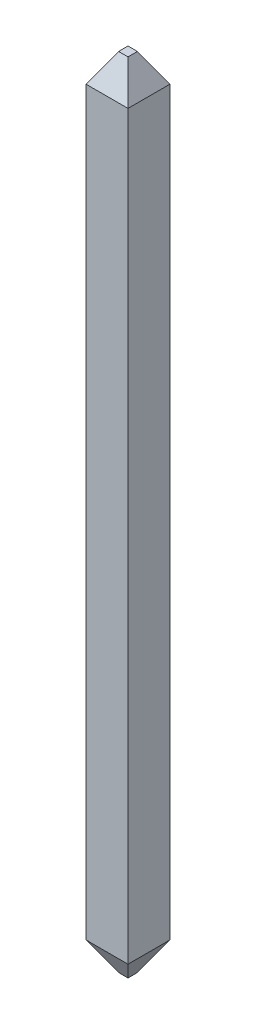
ISO-10303-21;
HEADER;
FILE_DESCRIPTION(('STEP AP214'),'2;1');
FILE_NAME('part.step','',(''),(''),'','','');
FILE_SCHEMA(('AUTOMOTIVE_DESIGN { 1 0 10303 214 1 1 1 1 }'));
ENDSEC;
DATA;
#1=APPLICATION_CONTEXT('core data for automotive mechanical design processes');
#2=APPLICATION_PROTOCOL_DEFINITION('international standard','automotive_design',2000,#1);
#3=PRODUCT_CONTEXT('',#1,'mechanical');
#4=PRODUCT('Part','Part','',(#3));
#5=PRODUCT_RELATED_PRODUCT_CATEGORY('part','',(#4));
#6=PRODUCT_DEFINITION_FORMATION('','',#4);
#7=PRODUCT_DEFINITION_CONTEXT('part definition',#1,'design');
#8=PRODUCT_DEFINITION('design','',#6,#7);
#9=PRODUCT_DEFINITION_SHAPE('','',#8);
#10=(LENGTH_UNIT() NAMED_UNIT(*) SI_UNIT(.MILLI.,.METRE.));
#11=(NAMED_UNIT(*) PLANE_ANGLE_UNIT() SI_UNIT($,.RADIAN.));
#12=(NAMED_UNIT(*) SI_UNIT($,.STERADIAN.) SOLID_ANGLE_UNIT());
#13=UNCERTAINTY_MEASURE_WITH_UNIT(LENGTH_MEASURE(1.E-05),#10,'distance_accuracy_value','');
#14=(GEOMETRIC_REPRESENTATION_CONTEXT(3) GLOBAL_UNCERTAINTY_ASSIGNED_CONTEXT((#13)) GLOBAL_UNIT_ASSIGNED_CONTEXT((#10,
#11,#12)) REPRESENTATION_CONTEXT('',''));
#15=CARTESIAN_POINT('',(0.,0.,0.));
#16=DIRECTION('',(0.,0.,1.));
#17=DIRECTION('',(1.,0.,0.));
#18=AXIS2_PLACEMENT_3D('',#15,#16,#17);
#19=CARTESIAN_POINT('',(-0.075,12.7,0.));
#20=DIRECTION('',(-0.866025403784436,0.5,0.));
#21=DIRECTION('',(0.,0.,1.));
#22=AXIS2_PLACEMENT_3D('',#19,#20,#21);
#23=PLANE('',#22);
#24=DIRECTION('',(-0.447213595499961,-0.774596669241479,0.447213595499962));
#25=VECTOR('',#24,1.);
#26=CARTESIAN_POINT('',(-0.075,12.7,0.0749999999999992));
#27=LINE('',#26,#25);
#28=CARTESIAN_POINT('',(-0.075,12.7,0.0749999999999992));
#29=VERTEX_POINT('',#28);
#30=CARTESIAN_POINT('',(-0.335,12.2496667900321,0.335));
#31=VERTEX_POINT('',#30);
#32=EDGE_CURVE('E106',#29,#31,#27,.T.);
#33=ORIENTED_EDGE('',*,*,#32,.F.);
#34=DIRECTION('',(0.,0.,1.));
#35=VECTOR('',#34,1.);
#36=CARTESIAN_POINT('',(-0.075,12.7,0.));
#37=LINE('',#36,#35);
#38=CARTESIAN_POINT('',(-0.075,12.7,-0.075));
#39=VERTEX_POINT('',#38);
#40=EDGE_CURVE('E11',#39,#29,#37,.T.);
#41=ORIENTED_EDGE('',*,*,#40,.F.);
#42=DIRECTION('',(0.447213595499962,0.774596669241479,0.447213595499962));
#43=VECTOR('',#42,1.);
#44=CARTESIAN_POINT('',(-0.335,12.2496667900321,-0.335));
#45=LINE('',#44,#43);
#46=CARTESIAN_POINT('',(-0.335,12.2496667900321,-0.335));
#47=VERTEX_POINT('',#46);
#48=EDGE_CURVE('E138',#47,#39,#45,.T.);
#49=ORIENTED_EDGE('',*,*,#48,.F.);
#50=DIRECTION('',(0.,0.,1.));
#51=VECTOR('',#50,1.);
#52=CARTESIAN_POINT('',(-0.335,12.2496667900321,-0.335));
#53=LINE('',#52,#51);
#54=EDGE_CURVE('E108',#47,#31,#53,.T.);
#55=ORIENTED_EDGE('',*,*,#54,.T.);
#56=EDGE_LOOP('',(#33,#41,#49,#55));
#57=FACE_BOUND('',#56,.T.);
#58=ADVANCED_FACE('F17',(#57),#23,.T.);
#59=CARTESIAN_POINT('',(-0.335,0.45033320996791,-0.335));
#60=DIRECTION('',(0.866025403784439,0.5,0.));
#61=DIRECTION('',(0.,0.,-1.));
#62=AXIS2_PLACEMENT_3D('',#59,#60,#61);
#63=PLANE('',#62);
#64=DIRECTION('',(0.,0.,-1.));
#65=VECTOR('',#64,1.);
#66=CARTESIAN_POINT('',(-0.335,0.45033320996791,-0.335));
#67=LINE('',#66,#65);
#68=CARTESIAN_POINT('',(-0.335,0.45033320996791,0.335));
#69=VERTEX_POINT('',#68);
#70=CARTESIAN_POINT('',(-0.335,0.45033320996791,-0.335));
#71=VERTEX_POINT('',#70);
#72=EDGE_CURVE('E152',#69,#71,#67,.T.);
#73=ORIENTED_EDGE('',*,*,#72,.T.);
#74=DIRECTION('',(0.447213595499958,-0.774596669241484,0.447213595499957));
#75=VECTOR('',#74,1.);
#76=CARTESIAN_POINT('',(-0.335,0.45033320996791,-0.335));
#77=LINE('',#76,#75);
#78=CARTESIAN_POINT('',(-0.075,0.,-0.075));
#79=VERTEX_POINT('',#78);
#80=EDGE_CURVE('E135',#71,#79,#77,.T.);
#81=ORIENTED_EDGE('',*,*,#80,.T.);
#82=DIRECTION('',(0.,0.,1.));
#83=VECTOR('',#82,1.);
#84=CARTESIAN_POINT('',(-0.075,0.,0.));
#85=LINE('',#84,#83);
#86=CARTESIAN_POINT('',(-0.075,0.,0.0749999999999992));
#87=VERTEX_POINT('',#86);
#88=EDGE_CURVE('E94',#79,#87,#85,.T.);
#89=ORIENTED_EDGE('',*,*,#88,.T.);
#90=DIRECTION('',(-0.447213595499957,0.774596669241484,0.447213595499957));
#91=VECTOR('',#90,1.);
#92=CARTESIAN_POINT('',(-0.075,0.,0.0749999999999992));
#93=LINE('',#92,#91);
#94=EDGE_CURVE('E120',#87,#69,#93,.T.);
#95=ORIENTED_EDGE('',*,*,#94,.T.);
#96=EDGE_LOOP('',(#73,#81,#89,#95));
#97=FACE_BOUND('',#96,.T.);
#98=ADVANCED_FACE('F430',(#97),#63,.F.);
#99=CARTESIAN_POINT('',(0.,12.7,0.));
#100=DIRECTION('',(0.,1.,0.));
#101=DIRECTION('',(1.,0.,0.));
#102=AXIS2_PLACEMENT_3D('',#99,#100,#101);
#103=PLANE('',#102);
#104=DIRECTION('',(0.,0.,1.));
#105=VECTOR('',#104,1.);
#106=CARTESIAN_POINT('',(0.075,12.7,0.));
#107=LINE('',#106,#105);
#108=CARTESIAN_POINT('',(0.075,12.7,-0.075));
#109=VERTEX_POINT('',#108);
#110=CARTESIAN_POINT('',(0.075,12.7,0.0749999999999992));
#111=VERTEX_POINT('',#110);
#112=EDGE_CURVE('E149',#109,#111,#107,.T.);
#113=ORIENTED_EDGE('',*,*,#112,.F.);
#114=DIRECTION('',(1.,0.,0.));
#115=VECTOR('',#114,1.);
#116=CARTESIAN_POINT('',(0.,12.7,-0.075));
#117=LINE('',#116,#115);
#118=EDGE_CURVE('E27',#39,#109,#117,.T.);
#119=ORIENTED_EDGE('',*,*,#118,.F.);
#120=ORIENTED_EDGE('',*,*,#40,.T.);
#121=DIRECTION('',(-1.,0.,0.));
#122=VECTOR('',#121,1.);
#123=CARTESIAN_POINT('',(0.,12.7,0.0749999999999992));
#124=LINE('',#123,#122);
#125=EDGE_CURVE('E102',#111,#29,#124,.T.);
#126=ORIENTED_EDGE('',*,*,#125,.F.);
#127=EDGE_LOOP('',(#113,#119,#120,#126));
#128=FACE_BOUND('',#127,.T.);
#129=ADVANCED_FACE('F19',(#128),#103,.T.);
#130=CARTESIAN_POINT('',(0.,12.7,-0.075));
#131=DIRECTION('',(0.,0.5,-0.866025403784436));
#132=DIRECTION('',(-1.,0.,0.));
#133=AXIS2_PLACEMENT_3D('',#130,#131,#132);
#134=PLANE('',#133);
#135=ORIENTED_EDGE('',*,*,#48,.T.);
#136=ORIENTED_EDGE('',*,*,#118,.T.);
#137=DIRECTION('',(-0.447213595499962,0.774596669241479,0.447213595499962));
#138=VECTOR('',#137,1.);
#139=CARTESIAN_POINT('',(0.335,12.2496667900321,-0.335));
#140=LINE('',#139,#138);
#141=CARTESIAN_POINT('',(0.335,12.2496667900321,-0.335));
#142=VERTEX_POINT('',#141);
#143=EDGE_CURVE('E147',#142,#109,#140,.T.);
#144=ORIENTED_EDGE('',*,*,#143,.F.);
#145=DIRECTION('',(-1.,0.,0.));
#146=VECTOR('',#145,1.);
#147=CARTESIAN_POINT('',(-0.335,12.2496667900321,-0.335));
#148=LINE('',#147,#146);
#149=EDGE_CURVE('E164',#142,#47,#148,.T.);
#150=ORIENTED_EDGE('',*,*,#149,.T.);
#151=EDGE_LOOP('',(#135,#136,#144,#150));
#152=FACE_BOUND('',#151,.T.);
#153=ADVANCED_FACE('F144',(#152),#134,.T.);
#154=CARTESIAN_POINT('',(-0.335,0.45033320996791,-0.335));
#155=DIRECTION('',(0.,0.5,0.866025403784439));
#156=DIRECTION('',(1.,0.,0.));
#157=AXIS2_PLACEMENT_3D('',#154,#155,#156);
#158=PLANE('',#157);
#159=DIRECTION('',(-1.,0.,0.));
#160=VECTOR('',#159,1.);
#161=CARTESIAN_POINT('',(0.,0.,-0.075));
#162=LINE('',#161,#160);
#163=CARTESIAN_POINT('',(0.075,0.,-0.075));
#164=VERTEX_POINT('',#163);
#165=EDGE_CURVE('E113',#164,#79,#162,.T.);
#166=ORIENTED_EDGE('',*,*,#165,.T.);
#167=ORIENTED_EDGE('',*,*,#80,.F.);
#168=DIRECTION('',(1.,0.,0.));
#169=VECTOR('',#168,1.);
#170=CARTESIAN_POINT('',(-0.335,0.45033320996791,-0.335));
#171=LINE('',#170,#169);
#172=CARTESIAN_POINT('',(0.335,0.45033320996791,-0.335));
#173=VERTEX_POINT('',#172);
#174=EDGE_CURVE('E178',#71,#173,#171,.T.);
#175=ORIENTED_EDGE('',*,*,#174,.T.);
#176=DIRECTION('',(-0.447213595499957,-0.774596669241484,0.447213595499957));
#177=VECTOR('',#176,1.);
#178=CARTESIAN_POINT('',(0.335,0.45033320996791,-0.335));
#179=LINE('',#178,#177);
#180=EDGE_CURVE('E275',#173,#164,#179,.T.);
#181=ORIENTED_EDGE('',*,*,#180,.T.);
#182=EDGE_LOOP('',(#166,#167,#175,#181));
#183=FACE_BOUND('',#182,.T.);
#184=ADVANCED_FACE('F442',(#183),#158,.F.);
#185=CARTESIAN_POINT('',(0.,0.,0.));
#186=DIRECTION('',(0.,1.,0.));
#187=DIRECTION('',(1.,0.,0.));
#188=AXIS2_PLACEMENT_3D('',#185,#186,#187);
#189=PLANE('',#188);
#190=ORIENTED_EDGE('',*,*,#165,.F.);
#191=DIRECTION('',(0.,0.,1.));
#192=VECTOR('',#191,1.);
#193=CARTESIAN_POINT('',(0.0749999999999992,0.,-0.335));
#194=LINE('',#193,#192);
#195=CARTESIAN_POINT('',(0.075,0.,0.0749999999999992));
#196=VERTEX_POINT('',#195);
#197=EDGE_CURVE('E177',#164,#196,#194,.T.);
#198=ORIENTED_EDGE('',*,*,#197,.T.);
#199=DIRECTION('',(-1.,0.,0.));
#200=VECTOR('',#199,1.);
#201=CARTESIAN_POINT('',(-0.335,0.,0.0749999999999992));
#202=LINE('',#201,#200);
#203=EDGE_CURVE('E126',#196,#87,#202,.T.);
#204=ORIENTED_EDGE('',*,*,#203,.T.);
#205=ORIENTED_EDGE('',*,*,#88,.F.);
#206=EDGE_LOOP('',(#190,#198,#204,#205));
#207=FACE_BOUND('',#206,.T.);
#208=ADVANCED_FACE('F452',(#207),#189,.F.);
#209=CARTESIAN_POINT('',(0.,12.7,0.0749999999999992));
#210=DIRECTION('',(0.,0.5,0.866025403784436));
#211=DIRECTION('',(1.,0.,0.));
#212=AXIS2_PLACEMENT_3D('',#209,#210,#211);
#213=PLANE('',#212);
#214=DIRECTION('',(0.447213595499962,-0.774596669241479,0.447213595499962));
#215=VECTOR('',#214,1.);
#216=CARTESIAN_POINT('',(0.075,12.7,0.0749999999999992));
#217=LINE('',#216,#215);
#218=CARTESIAN_POINT('',(0.335,12.2496667900321,0.335));
#219=VERTEX_POINT('',#218);
#220=EDGE_CURVE('E118',#111,#219,#217,.T.);
#221=ORIENTED_EDGE('',*,*,#220,.F.);
#222=ORIENTED_EDGE('',*,*,#125,.T.);
#223=ORIENTED_EDGE('',*,*,#32,.T.);
#224=DIRECTION('',(1.,0.,0.));
#225=VECTOR('',#224,1.);
#226=CARTESIAN_POINT('',(-0.335,12.2496667900321,0.335));
#227=LINE('',#226,#225);
#228=EDGE_CURVE('E170',#31,#219,#227,.T.);
#229=ORIENTED_EDGE('',*,*,#228,.T.);
#230=EDGE_LOOP('',(#221,#222,#223,#229));
#231=FACE_BOUND('',#230,.T.);
#232=ADVANCED_FACE('F116',(#231),#213,.T.);
#233=CARTESIAN_POINT('',(-0.335,0.45033320996791,0.335));
#234=DIRECTION('',(0.,0.5,-0.866025403784439));
#235=DIRECTION('',(-1.,0.,0.));
#236=AXIS2_PLACEMENT_3D('',#233,#234,#235);
#237=PLANE('',#236);
#238=ORIENTED_EDGE('',*,*,#203,.F.);
#239=DIRECTION('',(0.447213595499958,0.774596669241484,0.447213595499957));
#240=VECTOR('',#239,1.);
#241=CARTESIAN_POINT('',(0.075,0.,0.0749999999999992));
#242=LINE('',#241,#240);
#243=CARTESIAN_POINT('',(0.335,0.45033320996791,0.335));
#244=VERTEX_POINT('',#243);
#245=EDGE_CURVE('E183',#196,#244,#242,.T.);
#246=ORIENTED_EDGE('',*,*,#245,.T.);
#247=DIRECTION('',(-1.,0.,0.));
#248=VECTOR('',#247,1.);
#249=CARTESIAN_POINT('',(-0.335,0.45033320996791,0.335));
#250=LINE('',#249,#248);
#251=EDGE_CURVE('E174',#244,#69,#250,.T.);
#252=ORIENTED_EDGE('',*,*,#251,.T.);
#253=ORIENTED_EDGE('',*,*,#94,.F.);
#254=EDGE_LOOP('',(#238,#246,#252,#253));
#255=FACE_BOUND('',#254,.T.);
#256=ADVANCED_FACE('F316',(#255),#237,.F.);
#257=CARTESIAN_POINT('',(-0.335,12.7,-0.335));
#258=DIRECTION('',(1.,0.,0.));
#259=DIRECTION('',(0.,0.,-1.));
#260=AXIS2_PLACEMENT_3D('',#257,#258,#259);
#261=PLANE('',#260);
#262=ORIENTED_EDGE('',*,*,#72,.F.);
#263=DIRECTION('',(0.,1.,0.));
#264=VECTOR('',#263,1.);
#265=CARTESIAN_POINT('',(-0.335,12.7,0.335));
#266=LINE('',#265,#264);
#267=EDGE_CURVE('E173',#69,#31,#266,.T.);
#268=ORIENTED_EDGE('',*,*,#267,.T.);
#269=ORIENTED_EDGE('',*,*,#54,.F.);
#270=DIRECTION('',(0.,-1.,0.));
#271=VECTOR('',#270,1.);
#272=CARTESIAN_POINT('',(-0.335,12.7,-0.335));
#273=LINE('',#272,#271);
#274=EDGE_CURVE('E182',#47,#71,#273,.T.);
#275=ORIENTED_EDGE('',*,*,#274,.T.);
#276=EDGE_LOOP('',(#262,#268,#269,#275));
#277=FACE_BOUND('',#276,.T.);
#278=ADVANCED_FACE('F336',(#277),#261,.F.);
#279=CARTESIAN_POINT('',(0.075,12.7,0.));
#280=DIRECTION('',(0.866025403784436,0.5,0.));
#281=DIRECTION('',(0.,0.,-1.));
#282=AXIS2_PLACEMENT_3D('',#279,#280,#281);
#283=PLANE('',#282);
#284=ORIENTED_EDGE('',*,*,#220,.T.);
#285=DIRECTION('',(0.,0.,-1.));
#286=VECTOR('',#285,1.);
#287=CARTESIAN_POINT('',(0.335,12.2496667900321,-0.335));
#288=LINE('',#287,#286);
#289=EDGE_CURVE('E157',#219,#142,#288,.T.);
#290=ORIENTED_EDGE('',*,*,#289,.T.);
#291=ORIENTED_EDGE('',*,*,#143,.T.);
#292=ORIENTED_EDGE('',*,*,#112,.T.);
#293=EDGE_LOOP('',(#284,#290,#291,#292));
#294=FACE_BOUND('',#293,.T.);
#295=ADVANCED_FACE('F155',(#294),#283,.T.);
#296=CARTESIAN_POINT('',(-0.335,12.7,-0.335));
#297=DIRECTION('',(0.,0.,1.));
#298=DIRECTION('',(1.,0.,0.));
#299=AXIS2_PLACEMENT_3D('',#296,#297,#298);
#300=PLANE('',#299);
#301=ORIENTED_EDGE('',*,*,#174,.F.);
#302=ORIENTED_EDGE('',*,*,#274,.F.);
#303=ORIENTED_EDGE('',*,*,#149,.F.);
#304=DIRECTION('',(0.,-1.,0.));
#305=VECTOR('',#304,1.);
#306=CARTESIAN_POINT('',(0.335,12.7,-0.335));
#307=LINE('',#306,#305);
#308=EDGE_CURVE('E263',#142,#173,#307,.T.);
#309=ORIENTED_EDGE('',*,*,#308,.T.);
#310=EDGE_LOOP('',(#301,#302,#303,#309));
#311=FACE_BOUND('',#310,.T.);
#312=ADVANCED_FACE('F332',(#311),#300,.F.);
#313=CARTESIAN_POINT('',(0.335,0.45033320996791,-0.335));
#314=DIRECTION('',(-0.866025403784439,0.5,0.));
#315=DIRECTION('',(0.,0.,1.));
#316=AXIS2_PLACEMENT_3D('',#313,#314,#315);
#317=PLANE('',#316);
#318=ORIENTED_EDGE('',*,*,#197,.F.);
#319=ORIENTED_EDGE('',*,*,#180,.F.);
#320=DIRECTION('',(0.,0.,1.));
#321=VECTOR('',#320,1.);
#322=CARTESIAN_POINT('',(0.335,0.45033320996791,-0.335));
#323=LINE('',#322,#321);
#324=EDGE_CURVE('E287',#173,#244,#323,.T.);
#325=ORIENTED_EDGE('',*,*,#324,.T.);
#326=ORIENTED_EDGE('',*,*,#245,.F.);
#327=EDGE_LOOP('',(#318,#319,#325,#326));
#328=FACE_BOUND('',#327,.T.);
#329=ADVANCED_FACE('F328',(#328),#317,.F.);
#330=CARTESIAN_POINT('',(-0.335,12.7,0.335));
#331=DIRECTION('',(0.,0.,-1.));
#332=DIRECTION('',(0.,-1.,0.));
#333=AXIS2_PLACEMENT_3D('',#330,#331,#332);
#334=PLANE('',#333);
#335=ORIENTED_EDGE('',*,*,#251,.F.);
#336=DIRECTION('',(0.,1.,0.));
#337=VECTOR('',#336,1.);
#338=CARTESIAN_POINT('',(0.335,12.7,0.335));
#339=LINE('',#338,#337);
#340=EDGE_CURVE('E168',#244,#219,#339,.T.);
#341=ORIENTED_EDGE('',*,*,#340,.T.);
#342=ORIENTED_EDGE('',*,*,#228,.F.);
#343=ORIENTED_EDGE('',*,*,#267,.F.);
#344=EDGE_LOOP('',(#335,#341,#342,#343));
#345=FACE_BOUND('',#344,.T.);
#346=ADVANCED_FACE('F322',(#345),#334,.F.);
#347=CARTESIAN_POINT('',(0.335,12.7,-0.335));
#348=DIRECTION('',(-1.,0.,0.));
#349=DIRECTION('',(0.,1.,0.));
#350=AXIS2_PLACEMENT_3D('',#347,#348,#349);
#351=PLANE('',#350);
#352=ORIENTED_EDGE('',*,*,#324,.F.);
#353=ORIENTED_EDGE('',*,*,#308,.F.);
#354=ORIENTED_EDGE('',*,*,#289,.F.);
#355=ORIENTED_EDGE('',*,*,#340,.F.);
#356=EDGE_LOOP('',(#352,#353,#354,#355));
#357=FACE_BOUND('',#356,.T.);
#358=ADVANCED_FACE('F326',(#357),#351,.F.);
#359=CLOSED_SHELL('',(#58,#98,#129,#153,#184,#208,#232,#256,#278,#295,#312,#329,#346,#358));
#360=MANIFOLD_SOLID_BREP('B1',#359);
#361=ADVANCED_BREP_SHAPE_REPRESENTATION('',(#18,#360),#14);
#362=SHAPE_DEFINITION_REPRESENTATION(#9,#361);
ENDSEC;
END-ISO-10303-21;
